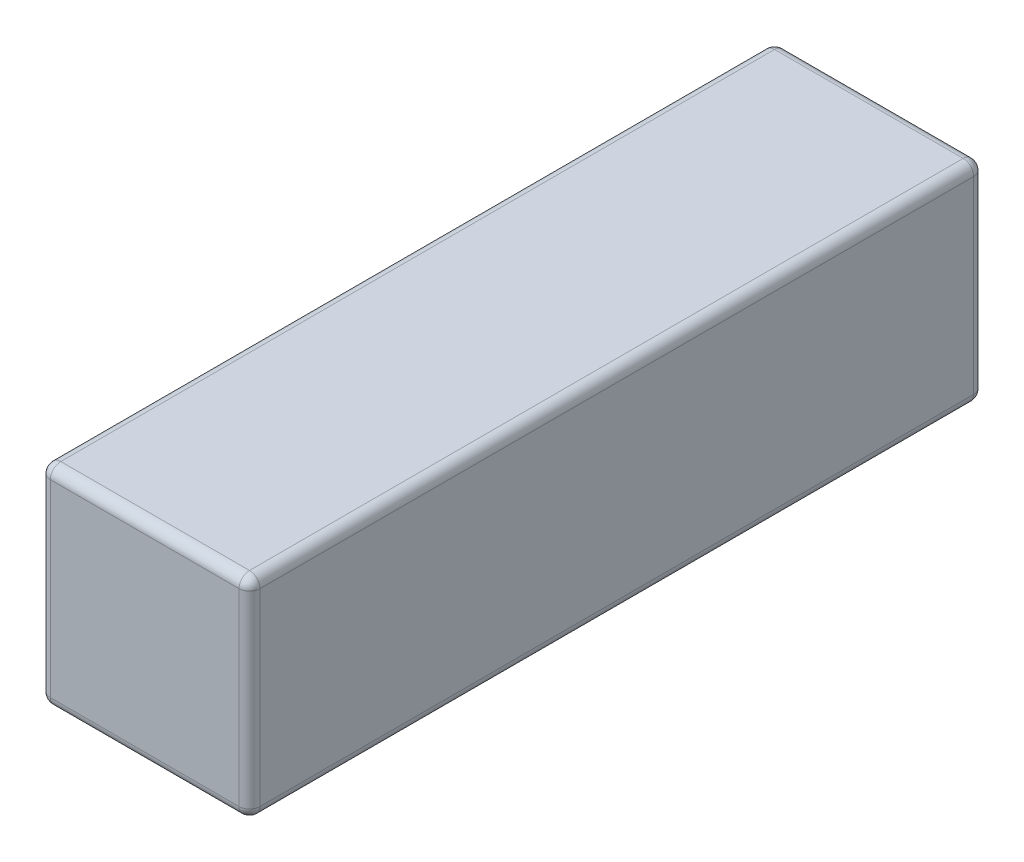
ISO-10303-21;
HEADER;
FILE_DESCRIPTION(('STEP AP214'),'2;1');
FILE_NAME('part.step','',(''),(''),'','','');
FILE_SCHEMA(('AUTOMOTIVE_DESIGN { 1 0 10303 214 1 1 1 1 }'));
ENDSEC;
DATA;
#1=APPLICATION_CONTEXT('core data for automotive mechanical design processes');
#2=APPLICATION_PROTOCOL_DEFINITION('international standard','automotive_design',2000,#1);
#3=PRODUCT_CONTEXT('',#1,'mechanical');
#4=PRODUCT('Part','Part','',(#3));
#5=PRODUCT_RELATED_PRODUCT_CATEGORY('part','',(#4));
#6=PRODUCT_DEFINITION_FORMATION('','',#4);
#7=PRODUCT_DEFINITION_CONTEXT('part definition',#1,'design');
#8=PRODUCT_DEFINITION('design','',#6,#7);
#9=PRODUCT_DEFINITION_SHAPE('','',#8);
#10=(LENGTH_UNIT() NAMED_UNIT(*) SI_UNIT(.MILLI.,.METRE.));
#11=(NAMED_UNIT(*) PLANE_ANGLE_UNIT() SI_UNIT($,.RADIAN.));
#12=(NAMED_UNIT(*) SI_UNIT($,.STERADIAN.) SOLID_ANGLE_UNIT());
#13=UNCERTAINTY_MEASURE_WITH_UNIT(LENGTH_MEASURE(1.E-05),#10,'distance_accuracy_value','');
#14=(GEOMETRIC_REPRESENTATION_CONTEXT(3) GLOBAL_UNCERTAINTY_ASSIGNED_CONTEXT((#13)) GLOBAL_UNIT_ASSIGNED_CONTEXT((#10,
#11,#12)) REPRESENTATION_CONTEXT('',''));
#15=CARTESIAN_POINT('',(0.,0.,0.));
#16=DIRECTION('',(0.,0.,1.));
#17=DIRECTION('',(1.,0.,0.));
#18=AXIS2_PLACEMENT_3D('',#15,#16,#17);
#19=CARTESIAN_POINT('',(0.,0.,89.0016));
#20=DIRECTION('',(1.,0.,0.));
#21=DIRECTION('',(0.,0.,-1.));
#22=AXIS2_PLACEMENT_3D('',#19,#20,#21);
#23=PLANE('',#22);
#24=DIRECTION('',(0.,-1.,0.));
#25=VECTOR('',#24,1.);
#26=CARTESIAN_POINT('',(0.,0.,1.26999999999999));
#27=LINE('',#26,#25);
#28=CARTESIAN_POINT('',(0.,24.13,1.26999999999999));
#29=VERTEX_POINT('',#28);
#30=CARTESIAN_POINT('',(0.,1.27,1.26999999999999));
#31=VERTEX_POINT('',#30);
#32=EDGE_CURVE('E192',#29,#31,#27,.T.);
#33=ORIENTED_EDGE('',*,*,#32,.T.);
#34=DIRECTION('',(0.,0.,-1.));
#35=VECTOR('',#34,1.);
#36=CARTESIAN_POINT('',(0.,1.27,89.0016));
#37=LINE('',#36,#35);
#38=CARTESIAN_POINT('',(0.,1.27,87.7316));
#39=VERTEX_POINT('',#38);
#40=EDGE_CURVE('E195',#31,#39,#37,.F.);
#41=ORIENTED_EDGE('',*,*,#40,.T.);
#42=DIRECTION('',(0.,-1.,0.));
#43=VECTOR('',#42,1.);
#44=CARTESIAN_POINT('',(0.,0.,87.7316));
#45=LINE('',#44,#43);
#46=CARTESIAN_POINT('',(0.,24.13,87.7316));
#47=VERTEX_POINT('',#46);
#48=EDGE_CURVE('E190',#39,#47,#45,.F.);
#49=ORIENTED_EDGE('',*,*,#48,.T.);
#50=DIRECTION('',(0.,0.,-1.));
#51=VECTOR('',#50,1.);
#52=CARTESIAN_POINT('',(0.,24.13,89.0016));
#53=LINE('',#52,#51);
#54=EDGE_CURVE('E188',#47,#29,#53,.T.);
#55=ORIENTED_EDGE('',*,*,#54,.T.);
#56=EDGE_LOOP('',(#33,#41,#49,#55));
#57=FACE_BOUND('',#56,.T.);
#58=ADVANCED_FACE('F33',(#57),#23,.F.);
#59=CARTESIAN_POINT('',(0.,0.,89.0016));
#60=DIRECTION('',(0.,1.,0.));
#61=DIRECTION('',(0.,0.,1.));
#62=AXIS2_PLACEMENT_3D('',#59,#60,#61);
#63=PLANE('',#62);
#64=DIRECTION('',(1.,0.,0.));
#65=VECTOR('',#64,1.);
#66=CARTESIAN_POINT('',(25.4,0.,1.26999999999999));
#67=LINE('',#66,#65);
#68=CARTESIAN_POINT('',(1.27,0.,1.26999999999999));
#69=VERTEX_POINT('',#68);
#70=CARTESIAN_POINT('',(24.13,0.,1.26999999999999));
#71=VERTEX_POINT('',#70);
#72=EDGE_CURVE('E132',#69,#71,#67,.T.);
#73=ORIENTED_EDGE('',*,*,#72,.T.);
#74=DIRECTION('',(0.,0.,-1.));
#75=VECTOR('',#74,1.);
#76=CARTESIAN_POINT('',(24.13,0.,89.0016));
#77=LINE('',#76,#75);
#78=CARTESIAN_POINT('',(24.13,0.,87.7316));
#79=VERTEX_POINT('',#78);
#80=EDGE_CURVE('E128',#71,#79,#77,.F.);
#81=ORIENTED_EDGE('',*,*,#80,.T.);
#82=DIRECTION('',(1.,0.,0.));
#83=VECTOR('',#82,1.);
#84=CARTESIAN_POINT('',(0.,0.,87.7316));
#85=LINE('',#84,#83);
#86=CARTESIAN_POINT('',(1.27,0.,87.7316));
#87=VERTEX_POINT('',#86);
#88=EDGE_CURVE('E120',#79,#87,#85,.F.);
#89=ORIENTED_EDGE('',*,*,#88,.T.);
#90=DIRECTION('',(0.,0.,-1.));
#91=VECTOR('',#90,1.);
#92=CARTESIAN_POINT('',(1.27,0.,89.0016));
#93=LINE('',#92,#91);
#94=EDGE_CURVE('E125',#87,#69,#93,.T.);
#95=ORIENTED_EDGE('',*,*,#94,.T.);
#96=EDGE_LOOP('',(#73,#81,#89,#95));
#97=FACE_BOUND('',#96,.T.);
#98=ADVANCED_FACE('F123',(#97),#63,.F.);
#99=CARTESIAN_POINT('',(25.4,0.,89.0016));
#100=DIRECTION('',(-1.,0.,0.));
#101=DIRECTION('',(0.,0.,1.));
#102=AXIS2_PLACEMENT_3D('',#99,#100,#101);
#103=PLANE('',#102);
#104=DIRECTION('',(0.,1.,0.));
#105=VECTOR('',#104,1.);
#106=CARTESIAN_POINT('',(25.4,0.,87.7316));
#107=LINE('',#106,#105);
#108=CARTESIAN_POINT('',(25.4,24.13,87.7316));
#109=VERTEX_POINT('',#108);
#110=CARTESIAN_POINT('',(25.4,1.27,87.7316));
#111=VERTEX_POINT('',#110);
#112=EDGE_CURVE('E172',#109,#111,#107,.F.);
#113=ORIENTED_EDGE('',*,*,#112,.T.);
#114=DIRECTION('',(0.,0.,-1.));
#115=VECTOR('',#114,1.);
#116=CARTESIAN_POINT('',(25.4,1.27,89.0016));
#117=LINE('',#116,#115);
#118=CARTESIAN_POINT('',(25.4,1.27,1.26999999999999));
#119=VERTEX_POINT('',#118);
#120=EDGE_CURVE('E177',#111,#119,#117,.T.);
#121=ORIENTED_EDGE('',*,*,#120,.T.);
#122=DIRECTION('',(0.,1.,0.));
#123=VECTOR('',#122,1.);
#124=CARTESIAN_POINT('',(25.4,25.4,1.26999999999999));
#125=LINE('',#124,#123);
#126=CARTESIAN_POINT('',(25.4,24.13,1.26999999999999));
#127=VERTEX_POINT('',#126);
#128=EDGE_CURVE('E174',#119,#127,#125,.T.);
#129=ORIENTED_EDGE('',*,*,#128,.T.);
#130=DIRECTION('',(0.,0.,-1.));
#131=VECTOR('',#130,1.);
#132=CARTESIAN_POINT('',(25.4,24.13,89.0016));
#133=LINE('',#132,#131);
#134=EDGE_CURVE('E170',#127,#109,#133,.F.);
#135=ORIENTED_EDGE('',*,*,#134,.T.);
#136=EDGE_LOOP('',(#113,#121,#129,#135));
#137=FACE_BOUND('',#136,.T.);
#138=ADVANCED_FACE('F263',(#137),#103,.F.);
#139=CARTESIAN_POINT('',(0.,25.4,89.0016));
#140=DIRECTION('',(0.,-1.,0.));
#141=DIRECTION('',(0.,0.,-1.));
#142=AXIS2_PLACEMENT_3D('',#139,#140,#141);
#143=PLANE('',#142);
#144=DIRECTION('',(-1.,0.,0.));
#145=VECTOR('',#144,1.);
#146=CARTESIAN_POINT('',(0.,25.4,1.26999999999999));
#147=LINE('',#146,#145);
#148=CARTESIAN_POINT('',(24.13,25.4,1.26999999999999));
#149=VERTEX_POINT('',#148);
#150=CARTESIAN_POINT('',(1.27,25.4,1.26999999999999));
#151=VERTEX_POINT('',#150);
#152=EDGE_CURVE('E183',#149,#151,#147,.T.);
#153=ORIENTED_EDGE('',*,*,#152,.T.);
#154=DIRECTION('',(0.,0.,-1.));
#155=VECTOR('',#154,1.);
#156=CARTESIAN_POINT('',(1.27,25.4,89.0016));
#157=LINE('',#156,#155);
#158=CARTESIAN_POINT('',(1.27,25.4,87.7316));
#159=VERTEX_POINT('',#158);
#160=EDGE_CURVE('E186',#151,#159,#157,.F.);
#161=ORIENTED_EDGE('',*,*,#160,.T.);
#162=DIRECTION('',(-1.,0.,0.));
#163=VECTOR('',#162,1.);
#164=CARTESIAN_POINT('',(0.,25.4,87.7316));
#165=LINE('',#164,#163);
#166=CARTESIAN_POINT('',(24.13,25.4,87.7316));
#167=VERTEX_POINT('',#166);
#168=EDGE_CURVE('E181',#159,#167,#165,.F.);
#169=ORIENTED_EDGE('',*,*,#168,.T.);
#170=DIRECTION('',(0.,0.,-1.));
#171=VECTOR('',#170,1.);
#172=CARTESIAN_POINT('',(24.13,25.4,89.0016));
#173=LINE('',#172,#171);
#174=EDGE_CURVE('E179',#167,#149,#173,.T.);
#175=ORIENTED_EDGE('',*,*,#174,.T.);
#176=EDGE_LOOP('',(#153,#161,#169,#175));
#177=FACE_BOUND('',#176,.T.);
#178=ADVANCED_FACE('F272',(#177),#143,.F.);
#179=CARTESIAN_POINT('',(0.,0.,89.0016));
#180=DIRECTION('',(0.,0.,-1.));
#181=DIRECTION('',(-1.,0.,0.));
#182=AXIS2_PLACEMENT_3D('',#179,#180,#181);
#183=PLANE('',#182);
#184=DIRECTION('',(0.,1.,0.));
#185=VECTOR('',#184,1.);
#186=CARTESIAN_POINT('',(24.13,0.,89.0016));
#187=LINE('',#186,#185);
#188=CARTESIAN_POINT('',(24.13,1.27,89.0016));
#189=VERTEX_POINT('',#188);
#190=CARTESIAN_POINT('',(24.13,24.13,89.0016));
#191=VERTEX_POINT('',#190);
#192=EDGE_CURVE('E42',#189,#191,#187,.T.);
#193=ORIENTED_EDGE('',*,*,#192,.T.);
#194=DIRECTION('',(-1.,0.,0.));
#195=VECTOR('',#194,1.);
#196=CARTESIAN_POINT('',(0.,24.13,89.0016));
#197=LINE('',#196,#195);
#198=CARTESIAN_POINT('',(1.27,24.13,89.0016));
#199=VERTEX_POINT('',#198);
#200=EDGE_CURVE('E11',#191,#199,#197,.T.);
#201=ORIENTED_EDGE('',*,*,#200,.T.);
#202=DIRECTION('',(0.,-1.,0.));
#203=VECTOR('',#202,1.);
#204=CARTESIAN_POINT('',(1.27,0.,89.0016));
#205=LINE('',#204,#203);
#206=CARTESIAN_POINT('',(1.27,1.27,89.0016));
#207=VERTEX_POINT('',#206);
#208=EDGE_CURVE('E197',#199,#207,#205,.T.);
#209=ORIENTED_EDGE('',*,*,#208,.T.);
#210=DIRECTION('',(1.,0.,0.));
#211=VECTOR('',#210,1.);
#212=CARTESIAN_POINT('',(0.,1.27,89.0016));
#213=LINE('',#212,#211);
#214=EDGE_CURVE('E53',#207,#189,#213,.T.);
#215=ORIENTED_EDGE('',*,*,#214,.T.);
#216=EDGE_LOOP('',(#193,#201,#209,#215));
#217=FACE_BOUND('',#216,.T.);
#218=ADVANCED_FACE('F294',(#217),#183,.F.);
#219=CARTESIAN_POINT('',(0.,0.,0.));
#220=DIRECTION('',(0.,0.,-1.));
#221=DIRECTION('',(-1.,0.,0.));
#222=AXIS2_PLACEMENT_3D('',#219,#220,#221);
#223=PLANE('',#222);
#224=DIRECTION('',(0.,1.,0.));
#225=VECTOR('',#224,1.);
#226=CARTESIAN_POINT('',(24.13,0.,0.));
#227=LINE('',#226,#225);
#228=CARTESIAN_POINT('',(24.13,24.13,0.));
#229=VERTEX_POINT('',#228);
#230=CARTESIAN_POINT('',(24.13,1.27,0.));
#231=VERTEX_POINT('',#230);
#232=EDGE_CURVE('E165',#229,#231,#227,.F.);
#233=ORIENTED_EDGE('',*,*,#232,.T.);
#234=DIRECTION('',(1.,0.,0.));
#235=VECTOR('',#234,1.);
#236=CARTESIAN_POINT('',(0.,1.27,0.));
#237=LINE('',#236,#235);
#238=CARTESIAN_POINT('',(1.27,1.27,0.));
#239=VERTEX_POINT('',#238);
#240=EDGE_CURVE('E167',#231,#239,#237,.F.);
#241=ORIENTED_EDGE('',*,*,#240,.T.);
#242=DIRECTION('',(0.,-1.,0.));
#243=VECTOR('',#242,1.);
#244=CARTESIAN_POINT('',(1.27,25.4,0.));
#245=LINE('',#244,#243);
#246=CARTESIAN_POINT('',(1.27,24.13,0.));
#247=VERTEX_POINT('',#246);
#248=EDGE_CURVE('E161',#239,#247,#245,.F.);
#249=ORIENTED_EDGE('',*,*,#248,.T.);
#250=DIRECTION('',(-1.,0.,0.));
#251=VECTOR('',#250,1.);
#252=CARTESIAN_POINT('',(25.4,24.13,0.));
#253=LINE('',#252,#251);
#254=EDGE_CURVE('E163',#247,#229,#253,.F.);
#255=ORIENTED_EDGE('',*,*,#254,.T.);
#256=EDGE_LOOP('',(#233,#241,#249,#255));
#257=FACE_BOUND('',#256,.T.);
#258=ADVANCED_FACE('F296',(#257),#223,.T.);
#259=CARTESIAN_POINT('',(0.,24.13,87.7316));
#260=DIRECTION('',(-1.,0.,0.));
#261=DIRECTION('',(0.,0.,1.));
#262=AXIS2_PLACEMENT_3D('',#259,#260,#261);
#263=CYLINDRICAL_SURFACE('',#262,1.27);
#264=CARTESIAN_POINT('',(1.27,24.13,87.7316));
#265=DIRECTION('',(-1.,0.,0.));
#266=DIRECTION('',(0.,0.,1.));
#267=AXIS2_PLACEMENT_3D('',#264,#265,#266);
#268=CIRCLE('',#267,1.27);
#269=EDGE_CURVE('E37',#199,#159,#268,.T.);
#270=ORIENTED_EDGE('',*,*,#269,.F.);
#271=ORIENTED_EDGE('',*,*,#200,.F.);
#272=CARTESIAN_POINT('',(24.13,24.13,87.7316));
#273=DIRECTION('',(1.,0.,0.));
#274=DIRECTION('',(0.,0.,-1.));
#275=AXIS2_PLACEMENT_3D('',#272,#273,#274);
#276=CIRCLE('',#275,1.27);
#277=EDGE_CURVE('E157',#167,#191,#276,.T.);
#278=ORIENTED_EDGE('',*,*,#277,.F.);
#279=ORIENTED_EDGE('',*,*,#168,.F.);
#280=EDGE_LOOP('',(#270,#271,#278,#279));
#281=FACE_BOUND('',#280,.T.);
#282=ADVANCED_FACE('F35',(#281),#263,.T.);
#283=CARTESIAN_POINT('',(1.27,24.13,87.7316));
#284=DIRECTION('',(0.,0.,1.));
#285=DIRECTION('',(1.,0.,0.));
#286=AXIS2_PLACEMENT_3D('',#283,#284,#285);
#287=SPHERICAL_SURFACE('',#286,1.27);
#288=CARTESIAN_POINT('',(1.27,24.13,87.7316));
#289=DIRECTION('',(0.,1.,0.));
#290=DIRECTION('',(0.,0.,1.));
#291=AXIS2_PLACEMENT_3D('',#288,#289,#290);
#292=CIRCLE('',#291,1.27);
#293=EDGE_CURVE('E243',#199,#47,#292,.F.);
#294=ORIENTED_EDGE('',*,*,#293,.F.);
#295=ORIENTED_EDGE('',*,*,#269,.T.);
#296=CARTESIAN_POINT('',(1.27,24.13,87.7316));
#297=DIRECTION('',(0.,0.,1.));
#298=DIRECTION('',(1.,0.,0.));
#299=AXIS2_PLACEMENT_3D('',#296,#297,#298);
#300=CIRCLE('',#299,1.27);
#301=EDGE_CURVE('E246',#47,#159,#300,.F.);
#302=ORIENTED_EDGE('',*,*,#301,.F.);
#303=EDGE_LOOP('',(#294,#295,#302));
#304=FACE_BOUND('',#303,.T.);
#305=ADVANCED_FACE('F290',(#304),#287,.T.);
#306=CARTESIAN_POINT('',(24.13,24.13,87.7316));
#307=DIRECTION('',(0.,0.,1.));
#308=DIRECTION('',(1.,0.,0.));
#309=AXIS2_PLACEMENT_3D('',#306,#307,#308);
#310=SPHERICAL_SURFACE('',#309,1.27);
#311=CARTESIAN_POINT('',(24.13,24.13,87.7316));
#312=DIRECTION('',(0.,0.,1.));
#313=DIRECTION('',(1.,0.,0.));
#314=AXIS2_PLACEMENT_3D('',#311,#312,#313);
#315=CIRCLE('',#314,1.27);
#316=EDGE_CURVE('E237',#167,#109,#315,.F.);
#317=ORIENTED_EDGE('',*,*,#316,.F.);
#318=ORIENTED_EDGE('',*,*,#277,.T.);
#319=CARTESIAN_POINT('',(24.13,24.13,87.7316));
#320=DIRECTION('',(0.,1.,0.));
#321=DIRECTION('',(0.,0.,1.));
#322=AXIS2_PLACEMENT_3D('',#319,#320,#321);
#323=CIRCLE('',#322,1.27);
#324=EDGE_CURVE('E240',#109,#191,#323,.F.);
#325=ORIENTED_EDGE('',*,*,#324,.F.);
#326=EDGE_LOOP('',(#317,#318,#325));
#327=FACE_BOUND('',#326,.T.);
#328=ADVANCED_FACE('F253',(#327),#310,.T.);
#329=CARTESIAN_POINT('',(1.27,24.13,89.0016));
#330=DIRECTION('',(0.,0.,-1.));
#331=DIRECTION('',(-1.,0.,0.));
#332=AXIS2_PLACEMENT_3D('',#329,#330,#331);
#333=CYLINDRICAL_SURFACE('',#332,1.27);
#334=ORIENTED_EDGE('',*,*,#301,.T.);
#335=ORIENTED_EDGE('',*,*,#160,.F.);
#336=CARTESIAN_POINT('',(1.27,24.13,1.26999999999999));
#337=DIRECTION('',(0.,0.,-1.));
#338=DIRECTION('',(-1.,0.,0.));
#339=AXIS2_PLACEMENT_3D('',#336,#337,#338);
#340=CIRCLE('',#339,1.27);
#341=EDGE_CURVE('E232',#29,#151,#340,.T.);
#342=ORIENTED_EDGE('',*,*,#341,.F.);
#343=ORIENTED_EDGE('',*,*,#54,.F.);
#344=EDGE_LOOP('',(#334,#335,#342,#343));
#345=FACE_BOUND('',#344,.T.);
#346=ADVANCED_FACE('F284',(#345),#333,.T.);
#347=CARTESIAN_POINT('',(1.27,0.,87.7316));
#348=DIRECTION('',(0.,-1.,0.));
#349=DIRECTION('',(0.,0.,-1.));
#350=AXIS2_PLACEMENT_3D('',#347,#348,#349);
#351=CYLINDRICAL_SURFACE('',#350,1.27);
#352=ORIENTED_EDGE('',*,*,#293,.T.);
#353=ORIENTED_EDGE('',*,*,#48,.F.);
#354=CARTESIAN_POINT('',(1.27,1.27,87.7316));
#355=DIRECTION('',(0.,-1.,0.));
#356=DIRECTION('',(0.,0.,-1.));
#357=AXIS2_PLACEMENT_3D('',#354,#355,#356);
#358=CIRCLE('',#357,1.27);
#359=EDGE_CURVE('E141',#207,#39,#358,.T.);
#360=ORIENTED_EDGE('',*,*,#359,.F.);
#361=ORIENTED_EDGE('',*,*,#208,.F.);
#362=EDGE_LOOP('',(#352,#353,#360,#361));
#363=FACE_BOUND('',#362,.T.);
#364=ADVANCED_FACE('F293',(#363),#351,.T.);
#365=CARTESIAN_POINT('',(0.,1.27,87.7316));
#366=DIRECTION('',(1.,0.,0.));
#367=DIRECTION('',(0.,0.,-1.));
#368=AXIS2_PLACEMENT_3D('',#365,#366,#367);
#369=CYLINDRICAL_SURFACE('',#368,1.27);
#370=CARTESIAN_POINT('',(24.13,1.27,87.7316));
#371=DIRECTION('',(1.,0.,0.));
#372=DIRECTION('',(0.,0.,-1.));
#373=AXIS2_PLACEMENT_3D('',#370,#371,#372);
#374=CIRCLE('',#373,1.27);
#375=EDGE_CURVE('E142',#189,#79,#374,.T.);
#376=ORIENTED_EDGE('',*,*,#375,.F.);
#377=ORIENTED_EDGE('',*,*,#214,.F.);
#378=CARTESIAN_POINT('',(1.27,1.27,87.7316));
#379=DIRECTION('',(-1.,0.,0.));
#380=DIRECTION('',(0.,0.,1.));
#381=AXIS2_PLACEMENT_3D('',#378,#379,#380);
#382=CIRCLE('',#381,1.27);
#383=EDGE_CURVE('E135',#87,#207,#382,.T.);
#384=ORIENTED_EDGE('',*,*,#383,.F.);
#385=ORIENTED_EDGE('',*,*,#88,.F.);
#386=EDGE_LOOP('',(#376,#377,#384,#385));
#387=FACE_BOUND('',#386,.T.);
#388=ADVANCED_FACE('F137',(#387),#369,.T.);
#389=CARTESIAN_POINT('',(24.13,0.,87.7316));
#390=DIRECTION('',(0.,1.,0.));
#391=DIRECTION('',(0.,0.,1.));
#392=AXIS2_PLACEMENT_3D('',#389,#390,#391);
#393=CYLINDRICAL_SURFACE('',#392,1.27);
#394=ORIENTED_EDGE('',*,*,#324,.T.);
#395=ORIENTED_EDGE('',*,*,#192,.F.);
#396=CARTESIAN_POINT('',(24.13,1.27,87.7316));
#397=DIRECTION('',(0.,-1.,0.));
#398=DIRECTION('',(0.,0.,-1.));
#399=AXIS2_PLACEMENT_3D('',#396,#397,#398);
#400=CIRCLE('',#399,1.27);
#401=EDGE_CURVE('E227',#111,#189,#400,.T.);
#402=ORIENTED_EDGE('',*,*,#401,.F.);
#403=ORIENTED_EDGE('',*,*,#112,.F.);
#404=EDGE_LOOP('',(#394,#395,#402,#403));
#405=FACE_BOUND('',#404,.T.);
#406=ADVANCED_FACE('F259',(#405),#393,.T.);
#407=CARTESIAN_POINT('',(24.13,24.13,89.0016));
#408=DIRECTION('',(0.,0.,-1.));
#409=DIRECTION('',(-1.,0.,0.));
#410=AXIS2_PLACEMENT_3D('',#407,#408,#409);
#411=CYLINDRICAL_SURFACE('',#410,1.27);
#412=ORIENTED_EDGE('',*,*,#316,.T.);
#413=ORIENTED_EDGE('',*,*,#134,.F.);
#414=CARTESIAN_POINT('',(24.13,24.13,1.26999999999999));
#415=DIRECTION('',(0.,0.,-1.));
#416=DIRECTION('',(-1.,0.,0.));
#417=AXIS2_PLACEMENT_3D('',#414,#415,#416);
#418=CIRCLE('',#417,1.27);
#419=EDGE_CURVE('E224',#149,#127,#418,.T.);
#420=ORIENTED_EDGE('',*,*,#419,.F.);
#421=ORIENTED_EDGE('',*,*,#174,.F.);
#422=EDGE_LOOP('',(#412,#413,#420,#421));
#423=FACE_BOUND('',#422,.T.);
#424=ADVANCED_FACE('F269',(#423),#411,.T.);
#425=CARTESIAN_POINT('',(0.,24.13,1.26999999999999));
#426=DIRECTION('',(1.,0.,0.));
#427=DIRECTION('',(0.,0.,-1.));
#428=AXIS2_PLACEMENT_3D('',#425,#426,#427);
#429=CYLINDRICAL_SURFACE('',#428,1.27);
#430=CARTESIAN_POINT('',(1.27,24.13,1.26999999999999));
#431=DIRECTION('',(-1.,0.,0.));
#432=DIRECTION('',(0.,0.,1.));
#433=AXIS2_PLACEMENT_3D('',#430,#431,#432);
#434=CIRCLE('',#433,1.27);
#435=EDGE_CURVE('E234',#151,#247,#434,.T.);
#436=ORIENTED_EDGE('',*,*,#435,.F.);
#437=ORIENTED_EDGE('',*,*,#152,.F.);
#438=CARTESIAN_POINT('',(24.13,24.13,1.27));
#439=DIRECTION('',(1.,0.,0.));
#440=DIRECTION('',(0.,0.,-1.));
#441=AXIS2_PLACEMENT_3D('',#438,#439,#440);
#442=CIRCLE('',#441,1.27);
#443=EDGE_CURVE('E221',#229,#149,#442,.T.);
#444=ORIENTED_EDGE('',*,*,#443,.F.);
#445=ORIENTED_EDGE('',*,*,#254,.F.);
#446=EDGE_LOOP('',(#436,#437,#444,#445));
#447=FACE_BOUND('',#446,.T.);
#448=ADVANCED_FACE('F276',(#447),#429,.T.);
#449=CARTESIAN_POINT('',(1.27,24.13,1.27));
#450=DIRECTION('',(0.,0.,1.));
#451=DIRECTION('',(1.,0.,0.));
#452=AXIS2_PLACEMENT_3D('',#449,#450,#451);
#453=SPHERICAL_SURFACE('',#452,1.27);
#454=ORIENTED_EDGE('',*,*,#341,.T.);
#455=ORIENTED_EDGE('',*,*,#435,.T.);
#456=CARTESIAN_POINT('',(1.27,24.13,1.27));
#457=DIRECTION('',(0.,1.,0.));
#458=DIRECTION('',(0.,0.,1.));
#459=AXIS2_PLACEMENT_3D('',#456,#457,#458);
#460=CIRCLE('',#459,1.27);
#461=EDGE_CURVE('E149',#29,#247,#460,.F.);
#462=ORIENTED_EDGE('',*,*,#461,.F.);
#463=EDGE_LOOP('',(#454,#455,#462));
#464=FACE_BOUND('',#463,.T.);
#465=ADVANCED_FACE('F350',(#464),#453,.T.);
#466=CARTESIAN_POINT('',(1.27,1.27,87.7316));
#467=DIRECTION('',(0.,0.,1.));
#468=DIRECTION('',(1.,0.,0.));
#469=AXIS2_PLACEMENT_3D('',#466,#467,#468);
#470=SPHERICAL_SURFACE('',#469,1.27);
#471=ORIENTED_EDGE('',*,*,#383,.T.);
#472=ORIENTED_EDGE('',*,*,#359,.T.);
#473=CARTESIAN_POINT('',(1.27,1.27,87.7316));
#474=DIRECTION('',(0.,0.,1.));
#475=DIRECTION('',(1.,0.,0.));
#476=AXIS2_PLACEMENT_3D('',#473,#474,#475);
#477=CIRCLE('',#476,1.27);
#478=EDGE_CURVE('E145',#87,#39,#477,.F.);
#479=ORIENTED_EDGE('',*,*,#478,.F.);
#480=EDGE_LOOP('',(#471,#472,#479));
#481=FACE_BOUND('',#480,.T.);
#482=ADVANCED_FACE('F146',(#481),#470,.T.);
#483=CARTESIAN_POINT('',(24.13,1.27,87.7316));
#484=DIRECTION('',(0.,0.,1.));
#485=DIRECTION('',(1.,0.,0.));
#486=AXIS2_PLACEMENT_3D('',#483,#484,#485);
#487=SPHERICAL_SURFACE('',#486,1.27);
#488=ORIENTED_EDGE('',*,*,#401,.T.);
#489=ORIENTED_EDGE('',*,*,#375,.T.);
#490=CARTESIAN_POINT('',(24.13,1.27,87.7316));
#491=DIRECTION('',(0.,0.,1.));
#492=DIRECTION('',(1.,0.,0.));
#493=AXIS2_PLACEMENT_3D('',#490,#491,#492);
#494=CIRCLE('',#493,1.27);
#495=EDGE_CURVE('E150',#111,#79,#494,.F.);
#496=ORIENTED_EDGE('',*,*,#495,.F.);
#497=EDGE_LOOP('',(#488,#489,#496));
#498=FACE_BOUND('',#497,.T.);
#499=ADVANCED_FACE('F343',(#498),#487,.T.);
#500=CARTESIAN_POINT('',(24.13,24.13,1.27));
#501=DIRECTION('',(0.,0.,1.));
#502=DIRECTION('',(1.,0.,0.));
#503=AXIS2_PLACEMENT_3D('',#500,#501,#502);
#504=SPHERICAL_SURFACE('',#503,1.27);
#505=ORIENTED_EDGE('',*,*,#443,.T.);
#506=ORIENTED_EDGE('',*,*,#419,.T.);
#507=CARTESIAN_POINT('',(24.13,24.13,1.26999999999999));
#508=DIRECTION('',(0.,1.,0.));
#509=DIRECTION('',(0.,0.,1.));
#510=AXIS2_PLACEMENT_3D('',#507,#508,#509);
#511=CIRCLE('',#510,1.27);
#512=EDGE_CURVE('E215',#229,#127,#511,.F.);
#513=ORIENTED_EDGE('',*,*,#512,.F.);
#514=EDGE_LOOP('',(#505,#506,#513));
#515=FACE_BOUND('',#514,.T.);
#516=ADVANCED_FACE('F339',(#515),#504,.T.);
#517=CARTESIAN_POINT('',(1.27,0.,1.26999999999999));
#518=DIRECTION('',(0.,1.,0.));
#519=DIRECTION('',(0.,0.,1.));
#520=AXIS2_PLACEMENT_3D('',#517,#518,#519);
#521=CYLINDRICAL_SURFACE('',#520,1.27);
#522=ORIENTED_EDGE('',*,*,#461,.T.);
#523=ORIENTED_EDGE('',*,*,#248,.F.);
#524=CARTESIAN_POINT('',(1.27,1.27,1.26999999999999));
#525=DIRECTION('',(0.,-1.,0.));
#526=DIRECTION('',(0.,0.,-1.));
#527=AXIS2_PLACEMENT_3D('',#524,#525,#526);
#528=CIRCLE('',#527,1.27);
#529=EDGE_CURVE('E212',#31,#239,#528,.T.);
#530=ORIENTED_EDGE('',*,*,#529,.F.);
#531=ORIENTED_EDGE('',*,*,#32,.F.);
#532=EDGE_LOOP('',(#522,#523,#530,#531));
#533=FACE_BOUND('',#532,.T.);
#534=ADVANCED_FACE('F336',(#533),#521,.T.);
#535=CARTESIAN_POINT('',(1.27,1.27,89.0016));
#536=DIRECTION('',(0.,0.,-1.));
#537=DIRECTION('',(-1.,0.,0.));
#538=AXIS2_PLACEMENT_3D('',#535,#536,#537);
#539=CYLINDRICAL_SURFACE('',#538,1.27);
#540=ORIENTED_EDGE('',*,*,#478,.T.);
#541=ORIENTED_EDGE('',*,*,#40,.F.);
#542=CARTESIAN_POINT('',(1.27,1.27,1.26999999999999));
#543=DIRECTION('',(0.,0.,-1.));
#544=DIRECTION('',(-1.,0.,0.));
#545=AXIS2_PLACEMENT_3D('',#542,#543,#544);
#546=CIRCLE('',#545,1.27);
#547=EDGE_CURVE('E153',#69,#31,#546,.T.);
#548=ORIENTED_EDGE('',*,*,#547,.F.);
#549=ORIENTED_EDGE('',*,*,#94,.F.);
#550=EDGE_LOOP('',(#540,#541,#548,#549));
#551=FACE_BOUND('',#550,.T.);
#552=ADVANCED_FACE('F152',(#551),#539,.T.);
#553=CARTESIAN_POINT('',(24.13,1.27,89.0016));
#554=DIRECTION('',(0.,0.,-1.));
#555=DIRECTION('',(-1.,0.,0.));
#556=AXIS2_PLACEMENT_3D('',#553,#554,#555);
#557=CYLINDRICAL_SURFACE('',#556,1.27);
#558=ORIENTED_EDGE('',*,*,#495,.T.);
#559=ORIENTED_EDGE('',*,*,#80,.F.);
#560=CARTESIAN_POINT('',(24.13,1.27,1.26999999999999));
#561=DIRECTION('',(0.,0.,-1.));
#562=DIRECTION('',(-1.,0.,0.));
#563=AXIS2_PLACEMENT_3D('',#560,#561,#562);
#564=CIRCLE('',#563,1.27);
#565=EDGE_CURVE('E208',#119,#71,#564,.T.);
#566=ORIENTED_EDGE('',*,*,#565,.F.);
#567=ORIENTED_EDGE('',*,*,#120,.F.);
#568=EDGE_LOOP('',(#558,#559,#566,#567));
#569=FACE_BOUND('',#568,.T.);
#570=ADVANCED_FACE('F329',(#569),#557,.T.);
#571=CARTESIAN_POINT('',(24.13,0.,1.26999999999999));
#572=DIRECTION('',(0.,-1.,0.));
#573=DIRECTION('',(0.,0.,-1.));
#574=AXIS2_PLACEMENT_3D('',#571,#572,#573);
#575=CYLINDRICAL_SURFACE('',#574,1.27);
#576=ORIENTED_EDGE('',*,*,#512,.T.);
#577=ORIENTED_EDGE('',*,*,#128,.F.);
#578=CARTESIAN_POINT('',(24.13,1.27,1.27));
#579=DIRECTION('',(0.,-1.,0.));
#580=DIRECTION('',(1.,0.,0.));
#581=AXIS2_PLACEMENT_3D('',#578,#579,#580);
#582=CIRCLE('',#581,1.27);
#583=EDGE_CURVE('E205',#231,#119,#582,.T.);
#584=ORIENTED_EDGE('',*,*,#583,.F.);
#585=ORIENTED_EDGE('',*,*,#232,.F.);
#586=EDGE_LOOP('',(#576,#577,#584,#585));
#587=FACE_BOUND('',#586,.T.);
#588=ADVANCED_FACE('F325',(#587),#575,.T.);
#589=CARTESIAN_POINT('',(1.27,1.27,1.27));
#590=DIRECTION('',(0.,0.,1.));
#591=DIRECTION('',(1.,0.,0.));
#592=AXIS2_PLACEMENT_3D('',#589,#590,#591);
#593=SPHERICAL_SURFACE('',#592,1.27);
#594=ORIENTED_EDGE('',*,*,#547,.T.);
#595=ORIENTED_EDGE('',*,*,#529,.T.);
#596=CARTESIAN_POINT('',(1.27,1.27,1.27));
#597=DIRECTION('',(-1.,0.,0.));
#598=DIRECTION('',(0.,-1.,0.));
#599=AXIS2_PLACEMENT_3D('',#596,#597,#598);
#600=CIRCLE('',#599,1.27);
#601=EDGE_CURVE('E203',#69,#239,#600,.F.);
#602=ORIENTED_EDGE('',*,*,#601,.F.);
#603=EDGE_LOOP('',(#594,#595,#602));
#604=FACE_BOUND('',#603,.T.);
#605=ADVANCED_FACE('F321',(#604),#593,.T.);
#606=CARTESIAN_POINT('',(24.13,1.27,1.27));
#607=DIRECTION('',(0.,0.,1.));
#608=DIRECTION('',(1.,0.,0.));
#609=AXIS2_PLACEMENT_3D('',#606,#607,#608);
#610=SPHERICAL_SURFACE('',#609,1.27);
#611=ORIENTED_EDGE('',*,*,#583,.T.);
#612=ORIENTED_EDGE('',*,*,#565,.T.);
#613=CARTESIAN_POINT('',(24.13,1.27,1.26999999999999));
#614=DIRECTION('',(1.,0.,0.));
#615=DIRECTION('',(0.,0.,-1.));
#616=AXIS2_PLACEMENT_3D('',#613,#614,#615);
#617=CIRCLE('',#616,1.27);
#618=EDGE_CURVE('E201',#231,#71,#617,.F.);
#619=ORIENTED_EDGE('',*,*,#618,.F.);
#620=EDGE_LOOP('',(#611,#612,#619));
#621=FACE_BOUND('',#620,.T.);
#622=ADVANCED_FACE('F317',(#621),#610,.T.);
#623=CARTESIAN_POINT('',(0.,1.27,1.26999999999999));
#624=DIRECTION('',(-1.,0.,0.));
#625=DIRECTION('',(0.,0.,1.));
#626=AXIS2_PLACEMENT_3D('',#623,#624,#625);
#627=CYLINDRICAL_SURFACE('',#626,1.27);
#628=ORIENTED_EDGE('',*,*,#601,.T.);
#629=ORIENTED_EDGE('',*,*,#240,.F.);
#630=ORIENTED_EDGE('',*,*,#618,.T.);
#631=ORIENTED_EDGE('',*,*,#72,.F.);
#632=EDGE_LOOP('',(#628,#629,#630,#631));
#633=FACE_BOUND('',#632,.T.);
#634=ADVANCED_FACE('F314',(#633),#627,.T.);
#635=CLOSED_SHELL('',(#58,#98,#138,#178,#218,#258,#282,#305,#328,#346,#364,#388,#406,#424,#448,
#465,#482,#499,#516,#534,#552,#570,#588,#605,#622,#634));
#636=MANIFOLD_SOLID_BREP('B2',#635);
#637=ADVANCED_BREP_SHAPE_REPRESENTATION('',(#18,#636),#14);
#638=SHAPE_DEFINITION_REPRESENTATION(#9,#637);
ENDSEC;
END-ISO-10303-21;
